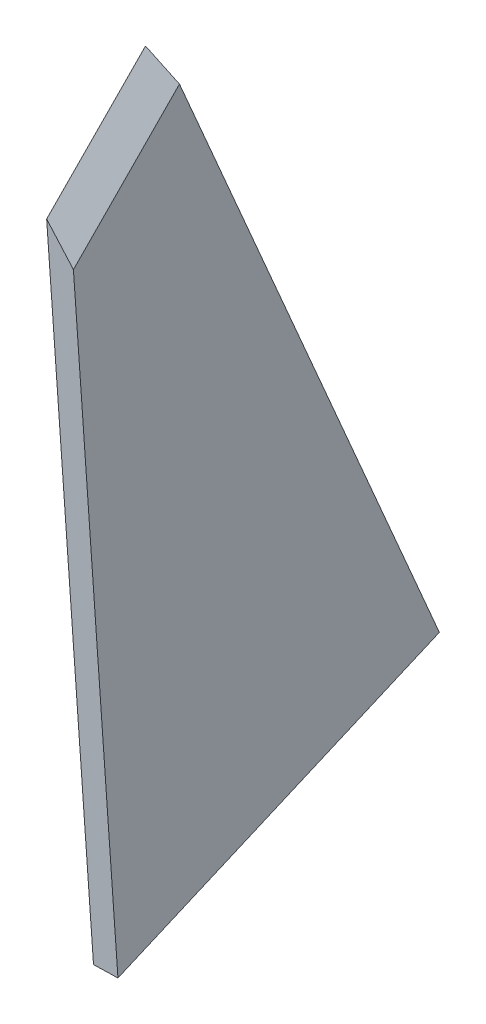
ISO-10303-21;
HEADER;
FILE_DESCRIPTION(('STEP AP214'),'2;1');
FILE_NAME('part.step','',(''),(''),'','','');
FILE_SCHEMA(('AUTOMOTIVE_DESIGN { 1 0 10303 214 1 1 1 1 }'));
ENDSEC;
DATA;
#1=APPLICATION_CONTEXT('core data for automotive mechanical design processes');
#2=APPLICATION_PROTOCOL_DEFINITION('international standard','automotive_design',2000,#1);
#3=PRODUCT_CONTEXT('',#1,'mechanical');
#4=PRODUCT('Part','Part','',(#3));
#5=PRODUCT_RELATED_PRODUCT_CATEGORY('part','',(#4));
#6=PRODUCT_DEFINITION_FORMATION('','',#4);
#7=PRODUCT_DEFINITION_CONTEXT('part definition',#1,'design');
#8=PRODUCT_DEFINITION('design','',#6,#7);
#9=PRODUCT_DEFINITION_SHAPE('','',#8);
#10=(LENGTH_UNIT() NAMED_UNIT(*) SI_UNIT(.MILLI.,.METRE.));
#11=(NAMED_UNIT(*) PLANE_ANGLE_UNIT() SI_UNIT($,.RADIAN.));
#12=(NAMED_UNIT(*) SI_UNIT($,.STERADIAN.) SOLID_ANGLE_UNIT());
#13=UNCERTAINTY_MEASURE_WITH_UNIT(LENGTH_MEASURE(1.E-05),#10,'distance_accuracy_value','');
#14=(GEOMETRIC_REPRESENTATION_CONTEXT(3) GLOBAL_UNCERTAINTY_ASSIGNED_CONTEXT((#13)) GLOBAL_UNIT_ASSIGNED_CONTEXT((#10,
#11,#12)) REPRESENTATION_CONTEXT('',''));
#15=CARTESIAN_POINT('',(0.,0.,0.));
#16=DIRECTION('',(0.,0.,1.));
#17=DIRECTION('',(1.,0.,0.));
#18=AXIS2_PLACEMENT_3D('',#15,#16,#17);
#19=CARTESIAN_POINT('',(-1.08157811672917E-12,0.,-2861.69092938569));
#20=DIRECTION('',(0.,0.,1.));
#21=DIRECTION('',(1.,0.,0.));
#22=AXIS2_PLACEMENT_3D('',#19,#20,#21);
#23=PLANE('',#22);
#24=DIRECTION('',(0.0750872608204781,-0.997176966873221,0.));
#25=VECTOR('',#24,1.);
#26=CARTESIAN_POINT('',(-17701.1847812344,-1332.89628887809,-2861.69092938569));
#27=LINE('',#26,#25);
#28=CARTESIAN_POINT('',(-19099.8806626948,17242.1229808663,-2861.69092938569));
#29=VERTEX_POINT('',#28);
#30=CARTESIAN_POINT('',(-19062.4800241917,16745.4334645076,-2861.69092938569));
#31=VERTEX_POINT('',#30);
#32=EDGE_CURVE('E41',#29,#31,#27,.T.);
#33=ORIENTED_EDGE('',*,*,#32,.T.);
#34=DIRECTION('',(0.999675941904622,0.0254560636608727,0.));
#35=VECTOR('',#34,1.);
#36=CARTESIAN_POINT('',(-438.487383262201,17219.6806904475,-2861.69092938569));
#37=LINE('',#36,#35);
#38=CARTESIAN_POINT('',(-19042.9766393514,16745.9301048541,-2861.69092938569));
#39=VERTEX_POINT('',#38);
#40=EDGE_CURVE('E88',#31,#39,#37,.T.);
#41=ORIENTED_EDGE('',*,*,#40,.T.);
#42=DIRECTION('',(0.0750872608204781,-0.997176966873221,0.));
#43=VECTOR('',#42,1.);
#44=CARTESIAN_POINT('',(-17681.7541722761,-1331.43316723447,-2861.69092938569));
#45=LINE('',#44,#43);
#46=CARTESIAN_POINT('',(-19078.5122865113,17217.8520855422,-2861.69092938569));
#47=VERTEX_POINT('',#46);
#48=EDGE_CURVE('E80',#47,#39,#45,.T.);
#49=ORIENTED_EDGE('',*,*,#48,.F.);
#50=DIRECTION('',(-0.660801953480024,0.750560309553459,0.));
#51=VECTOR('',#50,1.);
#52=CARTESIAN_POINT('',(-2208.13626767157,-1944.06863866219,-2861.69092938569));
#53=LINE('',#52,#51);
#54=EDGE_CURVE('E97',#47,#29,#53,.T.);
#55=ORIENTED_EDGE('',*,*,#54,.T.);
#56=EDGE_LOOP('',(#33,#41,#49,#55));
#57=FACE_BOUND('',#56,.T.);
#58=ADVANCED_FACE('F34',(#57),#23,.T.);
#59=CARTESIAN_POINT('',(-16212.5577482423,-1220.80291929176,3699.32162757958));
#60=DIRECTION('',(0.972325478966903,0.0732159478878802,-0.221861641404417));
#61=DIRECTION('',(-0.222458695883069,0.,-0.974942115525842));
#62=AXIS2_PLACEMENT_3D('',#59,#60,#61);
#63=PLANE('',#62);
#64=CARTESIAN_POINT('',(-19112.5158130893,17004.4011564558,-2995.51535788587));
#65=DIRECTION('',(-0.972325478966903,-0.0732159478878802,0.221861641404417));
#66=DIRECTION('',(0.222458695883069,0.,0.974942115525842));
#67=AXIS2_PLACEMENT_3D('',#64,#65,#66);
#68=CIRCLE('',#67,0.999999999999319);
#69=CARTESIAN_POINT('',(-19112.2933543934,17004.4011564558,-2994.54041577035));
#70=VERTEX_POINT('',#69);
#71=EDGE_CURVE('E118',#70,#70,#68,.T.);
#72=ORIENTED_EDGE('',*,*,#71,.F.);
#73=EDGE_LOOP('',(#72));
#74=FACE_BOUND('',#73,.T.);
#75=DIRECTION('',(-0.228075870197813,0.0916263530777755,-0.969322448339652));
#76=VECTOR('',#75,1.);
#77=CARTESIAN_POINT('',(-17088.274455431,15952.3234510087,5528.68273783818));
#78=LINE('',#77,#76);
#79=CARTESIAN_POINT('',(-19141.7758315223,16777.2894676603,-3198.69811054063));
#80=VERTEX_POINT('',#79);
#81=EDGE_CURVE('E48',#31,#80,#78,.T.);
#82=ORIENTED_EDGE('',*,*,#81,.F.);
#83=ORIENTED_EDGE('',*,*,#32,.F.);
#84=DIRECTION('',(-0.231743328737462,0.422702928180514,-0.876137696993629));
#85=VECTOR('',#84,1.);
#86=CARTESIAN_POINT('',(-19094.8107389222,17232.8753721605,-2842.52338155474));
#87=LINE('',#86,#85);
#88=CARTESIAN_POINT('',(-19128.2640821458,17293.8947172052,-2968.99837114057));
#89=VERTEX_POINT('',#88);
#90=EDGE_CURVE('E99',#29,#89,#87,.T.);
#91=ORIENTED_EDGE('',*,*,#90,.T.);
#92=DIRECTION('',(0.0238921384505505,0.913486759004081,0.406166353658792));
#93=VECTOR('',#92,1.);
#94=CARTESIAN_POINT('',(-19465.975193432,4381.9224729892,-8710.08726299753));
#95=LINE('',#94,#93);
#96=EDGE_CURVE('E87',#80,#89,#95,.T.);
#97=ORIENTED_EDGE('',*,*,#96,.F.);
#98=EDGE_LOOP('',(#82,#83,#91,#97));
#99=FACE_BOUND('',#98,.T.);
#100=ADVANCED_FACE('F116',(#74,#99),#63,.F.);
#101=CARTESIAN_POINT('',(-16194.0835641419,-1219.41181628189,3695.10625639289));
#102=DIRECTION('',(0.972325478966903,0.0732159478878802,-0.221861641404417));
#103=DIRECTION('',(-0.222458695883069,0.,-0.974942115525842));
#104=AXIS2_PLACEMENT_3D('',#101,#102,#103);
#105=PLANE('',#104);
#106=ORIENTED_EDGE('',*,*,#48,.T.);
#107=DIRECTION('',(-0.228075870197813,0.0916263530777755,-0.969322448339652));
#108=VECTOR('',#107,1.);
#109=CARTESIAN_POINT('',(-17069.7752307445,15953.2234989261,5524.41505718439));
#110=LINE('',#109,#108);
#111=CARTESIAN_POINT('',(-19121.9165467523,16777.6431300907,-3197.1855358393));
#112=VERTEX_POINT('',#111);
#113=EDGE_CURVE('E73',#39,#112,#110,.T.);
#114=ORIENTED_EDGE('',*,*,#113,.T.);
#115=DIRECTION('',(0.0238921384505505,0.913486759004081,0.406166353658792));
#116=VECTOR('',#115,1.);
#117=CARTESIAN_POINT('',(-19446.1496420602,4380.98638010324,-8709.14815606547));
#118=LINE('',#117,#116);
#119=CARTESIAN_POINT('',(-19108.9508073568,17273.3723542849,-2976.76796611711));
#120=VERTEX_POINT('',#119);
#121=EDGE_CURVE('E55',#112,#120,#118,.T.);
#122=ORIENTED_EDGE('',*,*,#121,.T.);
#123=DIRECTION('',(-0.231743328738406,0.422702928180574,-0.87613769699335));
#124=VECTOR('',#123,1.);
#125=CARTESIAN_POINT('',(-15786.2298904742,11212.6850035885,9585.2378862945));
#126=LINE('',#125,#124);
#127=EDGE_CURVE('E105',#47,#120,#126,.T.);
#128=ORIENTED_EDGE('',*,*,#127,.F.);
#129=EDGE_LOOP('',(#106,#114,#122,#128));
#130=FACE_BOUND('',#129,.T.);
#131=ADVANCED_FACE('F78',(#130),#105,.T.);
#132=CARTESIAN_POINT('',(-19377.4959385677,16702.9516704164,-3247.71294038254));
#133=DIRECTION('',(0.0623090556662005,0.404131751485578,-0.912576083964063));
#134=DIRECTION('',(0.,0.914352760089274,0.404918547509406));
#135=AXIS2_PLACEMENT_3D('',#132,#133,#134);
#136=PLANE('',#135);
#137=ORIENTED_EDGE('',*,*,#121,.F.);
#138=DIRECTION('',(-0.996954872040251,-0.0177541883860824,-0.0759326801183701));
#139=VECTOR('',#138,1.);
#140=CARTESIAN_POINT('',(-19381.0888108061,16773.027682261,-3216.92529054021));
#141=LINE('',#140,#139);
#142=EDGE_CURVE('E11',#112,#80,#141,.T.);
#143=ORIENTED_EDGE('',*,*,#142,.T.);
#144=ORIENTED_EDGE('',*,*,#96,.T.);
#145=DIRECTION('',(-0.66067913780507,0.702040290321816,0.26578658287056));
#146=VECTOR('',#145,1.);
#147=CARTESIAN_POINT('',(-18914.0176420622,17066.2355943572,-3055.18821117574));
#148=LINE('',#147,#146);
#149=EDGE_CURVE('E85',#120,#89,#148,.T.);
#150=ORIENTED_EDGE('',*,*,#149,.F.);
#151=EDGE_LOOP('',(#137,#143,#144,#150));
#152=FACE_BOUND('',#151,.T.);
#153=ADVANCED_FACE('F83',(#152),#136,.T.);
#154=CARTESIAN_POINT('',(-2431.31442577431,-2140.55726318872,-389.640722024561));
#155=DIRECTION('',(-0.745188859381135,-0.6560728667941,-0.119423437024789));
#156=DIRECTION('',(0.660801953480024,-0.750560309553459,0.));
#157=AXIS2_PLACEMENT_3D('',#154,#155,#156);
#158=PLANE('',#157);
#159=ORIENTED_EDGE('',*,*,#127,.T.);
#160=ORIENTED_EDGE('',*,*,#149,.T.);
#161=ORIENTED_EDGE('',*,*,#90,.F.);
#162=ORIENTED_EDGE('',*,*,#54,.F.);
#163=EDGE_LOOP('',(#159,#160,#161,#162));
#164=FACE_BOUND('',#163,.T.);
#165=ADVANCED_FACE('F141',(#164),#158,.F.);
#166=CARTESIAN_POINT('',(-17301.8765743334,16870.0823676626,-3655.74283161847));
#167=DIRECTION('',(0.0253285103268376,-0.9946668406923,-0.0999817112867244));
#168=DIRECTION('',(0.,0.100013797531207,-0.994986050305926));
#169=AXIS2_PLACEMENT_3D('',#166,#167,#168);
#170=PLANE('',#169);
#171=ORIENTED_EDGE('',*,*,#81,.T.);
#172=ORIENTED_EDGE('',*,*,#142,.F.);
#173=ORIENTED_EDGE('',*,*,#113,.F.);
#174=ORIENTED_EDGE('',*,*,#40,.F.);
#175=EDGE_LOOP('',(#171,#172,#173,#174));
#176=FACE_BOUND('',#175,.T.);
#177=ADVANCED_FACE('F72',(#176),#170,.T.);
#178=CARTESIAN_POINT('',(-19110.5711621314,17004.5475883516,-2995.95908116868));
#179=DIRECTION('',(-0.972325478966903,-0.0732159478878802,0.221861641404417));
#180=DIRECTION('',(0.222458695883069,0.,0.974942115525842));
#181=AXIS2_PLACEMENT_3D('',#178,#179,#180);
#182=CYLINDRICAL_SURFACE('',#181,0.999999999999319);
#183=CARTESIAN_POINT('',(-19110.5711621314,17004.5475883516,-2995.95908116868));
#184=DIRECTION('',(-0.972325478966903,-0.0732159478878802,0.221861641404417));
#185=DIRECTION('',(0.222458695883069,0.,0.974942115525842));
#186=AXIS2_PLACEMENT_3D('',#183,#184,#185);
#187=CIRCLE('',#186,0.999999999999319);
#188=CARTESIAN_POINT('',(-19110.3487034355,17004.5475883516,-2994.98413905315));
#189=VERTEX_POINT('',#188);
#190=EDGE_CURVE('E81',#189,#189,#187,.T.);
#191=ORIENTED_EDGE('',*,*,#190,.F.);
#192=EDGE_LOOP('',(#191));
#193=FACE_BOUND('',#192,.T.);
#194=ORIENTED_EDGE('',*,*,#71,.T.);
#195=EDGE_LOOP('',(#194));
#196=FACE_BOUND('',#195,.T.);
#197=ADVANCED_FACE('F126',(#193,#196),#182,.F.);
#198=CARTESIAN_POINT('',(-19110.5711621314,17004.5475883516,-2995.95908116868));
#199=DIRECTION('',(-0.972325478966903,-0.0732159478878802,0.221861641404417));
#200=DIRECTION('',(0.222458695883069,0.,0.974942115525842));
#201=AXIS2_PLACEMENT_3D('',#198,#199,#200);
#202=PLANE('',#201);
#203=ORIENTED_EDGE('',*,*,#190,.T.);
#204=EDGE_LOOP('',(#203));
#205=FACE_BOUND('',#204,.T.);
#206=ADVANCED_FACE('F124',(#205),#202,.T.);
#207=CLOSED_SHELL('',(#58,#100,#131,#153,#165,#177,#197,#206));
#208=MANIFOLD_SOLID_BREP('B2',#207);
#209=ADVANCED_BREP_SHAPE_REPRESENTATION('',(#18,#208),#14);
#210=SHAPE_DEFINITION_REPRESENTATION(#9,#209);
ENDSEC;
END-ISO-10303-21;
